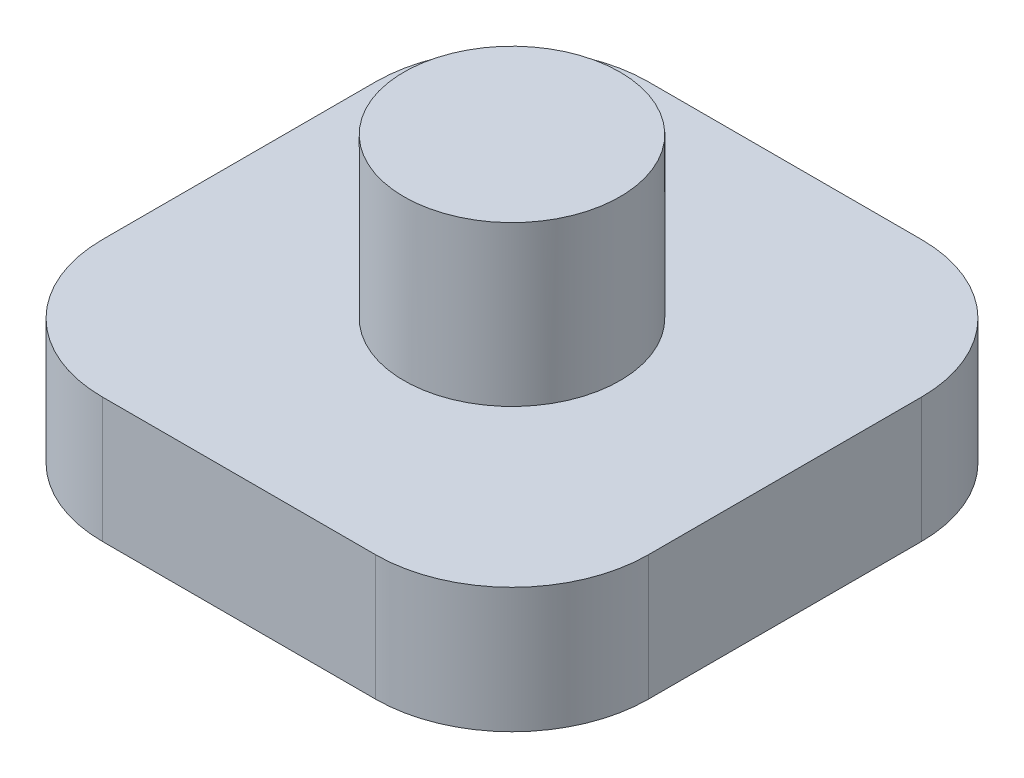
ISO-10303-21;
HEADER;
FILE_DESCRIPTION(('STEP AP214'),'2;1');
FILE_NAME('part.step','',(''),(''),'','','');
FILE_SCHEMA(('AUTOMOTIVE_DESIGN { 1 0 10303 214 1 1 1 1 }'));
ENDSEC;
DATA;
#1=APPLICATION_CONTEXT('core data for automotive mechanical design processes');
#2=APPLICATION_PROTOCOL_DEFINITION('international standard','automotive_design',2000,#1);
#3=PRODUCT_CONTEXT('',#1,'mechanical');
#4=PRODUCT('Part','Part','',(#3));
#5=PRODUCT_RELATED_PRODUCT_CATEGORY('part','',(#4));
#6=PRODUCT_DEFINITION_FORMATION('','',#4);
#7=PRODUCT_DEFINITION_CONTEXT('part definition',#1,'design');
#8=PRODUCT_DEFINITION('design','',#6,#7);
#9=PRODUCT_DEFINITION_SHAPE('','',#8);
#10=(LENGTH_UNIT() NAMED_UNIT(*) SI_UNIT(.MILLI.,.METRE.));
#11=(NAMED_UNIT(*) PLANE_ANGLE_UNIT() SI_UNIT($,.RADIAN.));
#12=(NAMED_UNIT(*) SI_UNIT($,.STERADIAN.) SOLID_ANGLE_UNIT());
#13=UNCERTAINTY_MEASURE_WITH_UNIT(LENGTH_MEASURE(1.E-05),#10,'distance_accuracy_value','');
#14=(GEOMETRIC_REPRESENTATION_CONTEXT(3) GLOBAL_UNCERTAINTY_ASSIGNED_CONTEXT((#13)) GLOBAL_UNIT_ASSIGNED_CONTEXT((#10,
#11,#12)) REPRESENTATION_CONTEXT('',''));
#15=CARTESIAN_POINT('',(0.,0.,0.));
#16=DIRECTION('',(0.,0.,1.));
#17=DIRECTION('',(1.,0.,0.));
#18=AXIS2_PLACEMENT_3D('',#15,#16,#17);
#19=CARTESIAN_POINT('',(0.,2.75,0.));
#20=DIRECTION('',(1.,0.,0.));
#21=DIRECTION('',(0.,0.,-1.));
#22=AXIS2_PLACEMENT_3D('',#19,#20,#21);
#23=PLANE('',#22);
#24=DIRECTION('',(0.,0.,1.));
#25=VECTOR('',#24,1.);
#26=CARTESIAN_POINT('',(0.,2.75,0.));
#27=LINE('',#26,#25);
#28=CARTESIAN_POINT('',(0.,2.75,-9.));
#29=VERTEX_POINT('',#28);
#30=CARTESIAN_POINT('',(0.,2.75,-3.));
#31=VERTEX_POINT('',#30);
#32=EDGE_CURVE('E127',#29,#31,#27,.T.);
#33=ORIENTED_EDGE('',*,*,#32,.F.);
#34=DIRECTION('',(0.,-1.,0.));
#35=VECTOR('',#34,1.);
#36=CARTESIAN_POINT('',(0.,2.75,-9.));
#37=LINE('',#36,#35);
#38=CARTESIAN_POINT('',(0.,0.,-9.));
#39=VERTEX_POINT('',#38);
#40=EDGE_CURVE('E11',#29,#39,#37,.T.);
#41=ORIENTED_EDGE('',*,*,#40,.T.);
#42=DIRECTION('',(0.,0.,1.));
#43=VECTOR('',#42,1.);
#44=CARTESIAN_POINT('',(0.,0.,0.));
#45=LINE('',#44,#43);
#46=CARTESIAN_POINT('',(0.,0.,-3.));
#47=VERTEX_POINT('',#46);
#48=EDGE_CURVE('E161',#39,#47,#45,.T.);
#49=ORIENTED_EDGE('',*,*,#48,.T.);
#50=DIRECTION('',(0.,-1.,0.));
#51=VECTOR('',#50,1.);
#52=CARTESIAN_POINT('',(0.,2.75,-3.));
#53=LINE('',#52,#51);
#54=EDGE_CURVE('E41',#47,#31,#53,.F.);
#55=ORIENTED_EDGE('',*,*,#54,.T.);
#56=EDGE_LOOP('',(#33,#41,#49,#55));
#57=FACE_BOUND('',#56,.T.);
#58=ADVANCED_FACE('F33',(#57),#23,.F.);
#59=CARTESIAN_POINT('',(0.,2.75,0.));
#60=DIRECTION('',(0.,0.,-1.));
#61=DIRECTION('',(-1.,0.,0.));
#62=AXIS2_PLACEMENT_3D('',#59,#60,#61);
#63=PLANE('',#62);
#64=DIRECTION('',(1.,0.,0.));
#65=VECTOR('',#64,1.);
#66=CARTESIAN_POINT('',(0.,0.,0.));
#67=LINE('',#66,#65);
#68=CARTESIAN_POINT('',(3.,0.,0.));
#69=VERTEX_POINT('',#68);
#70=CARTESIAN_POINT('',(9.,0.,0.));
#71=VERTEX_POINT('',#70);
#72=EDGE_CURVE('E132',#69,#71,#67,.T.);
#73=ORIENTED_EDGE('',*,*,#72,.T.);
#74=DIRECTION('',(0.,-1.,0.));
#75=VECTOR('',#74,1.);
#76=CARTESIAN_POINT('',(9.,2.75,0.));
#77=LINE('',#76,#75);
#78=CARTESIAN_POINT('',(9.,2.75,0.));
#79=VERTEX_POINT('',#78);
#80=EDGE_CURVE('E48',#71,#79,#77,.F.);
#81=ORIENTED_EDGE('',*,*,#80,.T.);
#82=DIRECTION('',(1.,0.,0.));
#83=VECTOR('',#82,1.);
#84=CARTESIAN_POINT('',(0.,2.75,0.));
#85=LINE('',#84,#83);
#86=CARTESIAN_POINT('',(3.,2.75,0.));
#87=VERTEX_POINT('',#86);
#88=EDGE_CURVE('E130',#87,#79,#85,.T.);
#89=ORIENTED_EDGE('',*,*,#88,.F.);
#90=DIRECTION('',(0.,-1.,0.));
#91=VECTOR('',#90,1.);
#92=CARTESIAN_POINT('',(3.,2.75,0.));
#93=LINE('',#92,#91);
#94=EDGE_CURVE('E153',#87,#69,#93,.T.);
#95=ORIENTED_EDGE('',*,*,#94,.T.);
#96=EDGE_LOOP('',(#73,#81,#89,#95));
#97=FACE_BOUND('',#96,.T.);
#98=ADVANCED_FACE('F168',(#97),#63,.F.);
#99=CARTESIAN_POINT('',(12.,2.75,0.));
#100=DIRECTION('',(-1.,0.,0.));
#101=DIRECTION('',(0.,0.,1.));
#102=AXIS2_PLACEMENT_3D('',#99,#100,#101);
#103=PLANE('',#102);
#104=DIRECTION('',(0.,0.,-1.));
#105=VECTOR('',#104,1.);
#106=CARTESIAN_POINT('',(12.,0.,0.));
#107=LINE('',#106,#105);
#108=CARTESIAN_POINT('',(12.,0.,-3.));
#109=VERTEX_POINT('',#108);
#110=CARTESIAN_POINT('',(12.,0.,-9.));
#111=VERTEX_POINT('',#110);
#112=EDGE_CURVE('E128',#109,#111,#107,.T.);
#113=ORIENTED_EDGE('',*,*,#112,.T.);
#114=DIRECTION('',(0.,-1.,0.));
#115=VECTOR('',#114,1.);
#116=CARTESIAN_POINT('',(12.,2.75,-9.));
#117=LINE('',#116,#115);
#118=CARTESIAN_POINT('',(12.,2.75,-9.));
#119=VERTEX_POINT('',#118);
#120=EDGE_CURVE('E105',#111,#119,#117,.F.);
#121=ORIENTED_EDGE('',*,*,#120,.T.);
#122=DIRECTION('',(0.,0.,-1.));
#123=VECTOR('',#122,1.);
#124=CARTESIAN_POINT('',(12.,2.75,0.));
#125=LINE('',#124,#123);
#126=CARTESIAN_POINT('',(12.,2.75,-3.));
#127=VERTEX_POINT('',#126);
#128=EDGE_CURVE('E173',#127,#119,#125,.T.);
#129=ORIENTED_EDGE('',*,*,#128,.F.);
#130=DIRECTION('',(0.,-1.,0.));
#131=VECTOR('',#130,1.);
#132=CARTESIAN_POINT('',(12.,2.75,-3.));
#133=LINE('',#132,#131);
#134=EDGE_CURVE('E110',#127,#109,#133,.T.);
#135=ORIENTED_EDGE('',*,*,#134,.T.);
#136=EDGE_LOOP('',(#113,#121,#129,#135));
#137=FACE_BOUND('',#136,.T.);
#138=ADVANCED_FACE('F194',(#137),#103,.F.);
#139=CARTESIAN_POINT('',(0.,2.75,-12.));
#140=DIRECTION('',(0.,0.,1.));
#141=DIRECTION('',(1.,0.,0.));
#142=AXIS2_PLACEMENT_3D('',#139,#140,#141);
#143=PLANE('',#142);
#144=DIRECTION('',(-1.,0.,0.));
#145=VECTOR('',#144,1.);
#146=CARTESIAN_POINT('',(0.,2.75,-12.));
#147=LINE('',#146,#145);
#148=CARTESIAN_POINT('',(9.,2.75,-12.));
#149=VERTEX_POINT('',#148);
#150=CARTESIAN_POINT('',(3.,2.75,-12.));
#151=VERTEX_POINT('',#150);
#152=EDGE_CURVE('E120',#149,#151,#147,.T.);
#153=ORIENTED_EDGE('',*,*,#152,.F.);
#154=DIRECTION('',(0.,-1.,0.));
#155=VECTOR('',#154,1.);
#156=CARTESIAN_POINT('',(9.,2.75,-12.));
#157=LINE('',#156,#155);
#158=CARTESIAN_POINT('',(9.,0.,-12.));
#159=VERTEX_POINT('',#158);
#160=EDGE_CURVE('E104',#149,#159,#157,.T.);
#161=ORIENTED_EDGE('',*,*,#160,.T.);
#162=DIRECTION('',(-1.,0.,0.));
#163=VECTOR('',#162,1.);
#164=CARTESIAN_POINT('',(0.,0.,-12.));
#165=LINE('',#164,#163);
#166=CARTESIAN_POINT('',(3.,0.,-12.));
#167=VERTEX_POINT('',#166);
#168=EDGE_CURVE('E117',#159,#167,#165,.T.);
#169=ORIENTED_EDGE('',*,*,#168,.T.);
#170=DIRECTION('',(0.,-1.,0.));
#171=VECTOR('',#170,1.);
#172=CARTESIAN_POINT('',(3.,2.75,-12.));
#173=LINE('',#172,#171);
#174=EDGE_CURVE('E122',#167,#151,#173,.F.);
#175=ORIENTED_EDGE('',*,*,#174,.T.);
#176=EDGE_LOOP('',(#153,#161,#169,#175));
#177=FACE_BOUND('',#176,.T.);
#178=ADVANCED_FACE('F116',(#177),#143,.F.);
#179=CARTESIAN_POINT('',(0.,2.75,0.));
#180=DIRECTION('',(0.,-1.,0.));
#181=DIRECTION('',(0.,0.,-1.));
#182=AXIS2_PLACEMENT_3D('',#179,#180,#181);
#183=PLANE('',#182);
#184=CARTESIAN_POINT('',(6.,2.75,-6.));
#185=DIRECTION('',(0.,-1.,0.));
#186=DIRECTION('',(0.,0.,-1.));
#187=AXIS2_PLACEMENT_3D('',#184,#185,#186);
#188=CIRCLE('',#187,2.375);
#189=CARTESIAN_POINT('',(6.,2.75,-8.375));
#190=VERTEX_POINT('',#189);
#191=EDGE_CURVE('E136',#190,#190,#188,.F.);
#192=ORIENTED_EDGE('',*,*,#191,.F.);
#193=EDGE_LOOP('',(#192));
#194=FACE_BOUND('',#193,.T.);
#195=ORIENTED_EDGE('',*,*,#128,.T.);
#196=CARTESIAN_POINT('',(9.,2.75,-9.));
#197=DIRECTION('',(0.,-1.,0.));
#198=DIRECTION('',(0.,0.,-1.));
#199=AXIS2_PLACEMENT_3D('',#196,#197,#198);
#200=CIRCLE('',#199,3.);
#201=EDGE_CURVE('E151',#119,#149,#200,.F.);
#202=ORIENTED_EDGE('',*,*,#201,.T.);
#203=ORIENTED_EDGE('',*,*,#152,.T.);
#204=CARTESIAN_POINT('',(3.,2.75,-9.));
#205=DIRECTION('',(0.,-1.,0.));
#206=DIRECTION('',(0.,0.,-1.));
#207=AXIS2_PLACEMENT_3D('',#204,#205,#206);
#208=CIRCLE('',#207,3.);
#209=EDGE_CURVE('E147',#151,#29,#208,.F.);
#210=ORIENTED_EDGE('',*,*,#209,.T.);
#211=ORIENTED_EDGE('',*,*,#32,.T.);
#212=CARTESIAN_POINT('',(3.,2.75,-3.));
#213=DIRECTION('',(0.,-1.,0.));
#214=DIRECTION('',(0.,0.,-1.));
#215=AXIS2_PLACEMENT_3D('',#212,#213,#214);
#216=CIRCLE('',#215,3.);
#217=EDGE_CURVE('E55',#31,#87,#216,.F.);
#218=ORIENTED_EDGE('',*,*,#217,.T.);
#219=ORIENTED_EDGE('',*,*,#88,.T.);
#220=CARTESIAN_POINT('',(9.,2.75,-3.));
#221=DIRECTION('',(0.,-1.,0.));
#222=DIRECTION('',(0.,0.,-1.));
#223=AXIS2_PLACEMENT_3D('',#220,#221,#222);
#224=CIRCLE('',#223,3.);
#225=EDGE_CURVE('E149',#79,#127,#224,.F.);
#226=ORIENTED_EDGE('',*,*,#225,.T.);
#227=EDGE_LOOP('',(#195,#202,#203,#210,#211,#218,#219,#226));
#228=FACE_BOUND('',#227,.T.);
#229=ADVANCED_FACE('F164',(#194,#228),#183,.F.);
#230=CARTESIAN_POINT('',(0.,0.,0.));
#231=DIRECTION('',(0.,-1.,0.));
#232=DIRECTION('',(0.,0.,-1.));
#233=AXIS2_PLACEMENT_3D('',#230,#231,#232);
#234=PLANE('',#233);
#235=ORIENTED_EDGE('',*,*,#168,.F.);
#236=CARTESIAN_POINT('',(9.,0.,-9.));
#237=DIRECTION('',(0.,-1.,0.));
#238=DIRECTION('',(0.,0.,-1.));
#239=AXIS2_PLACEMENT_3D('',#236,#237,#238);
#240=CIRCLE('',#239,3.);
#241=EDGE_CURVE('E100',#159,#111,#240,.T.);
#242=ORIENTED_EDGE('',*,*,#241,.T.);
#243=ORIENTED_EDGE('',*,*,#112,.F.);
#244=CARTESIAN_POINT('',(9.,0.,-3.));
#245=DIRECTION('',(0.,-1.,0.));
#246=DIRECTION('',(0.,0.,-1.));
#247=AXIS2_PLACEMENT_3D('',#244,#245,#246);
#248=CIRCLE('',#247,3.);
#249=EDGE_CURVE('E111',#109,#71,#248,.T.);
#250=ORIENTED_EDGE('',*,*,#249,.T.);
#251=ORIENTED_EDGE('',*,*,#72,.F.);
#252=CARTESIAN_POINT('',(3.,0.,-3.));
#253=DIRECTION('',(0.,-1.,0.));
#254=DIRECTION('',(0.,0.,-1.));
#255=AXIS2_PLACEMENT_3D('',#252,#253,#254);
#256=CIRCLE('',#255,3.);
#257=EDGE_CURVE('E121',#69,#47,#256,.T.);
#258=ORIENTED_EDGE('',*,*,#257,.T.);
#259=ORIENTED_EDGE('',*,*,#48,.F.);
#260=CARTESIAN_POINT('',(3.,0.,-9.));
#261=DIRECTION('',(0.,-1.,0.));
#262=DIRECTION('',(0.,0.,-1.));
#263=AXIS2_PLACEMENT_3D('',#260,#261,#262);
#264=CIRCLE('',#263,3.);
#265=EDGE_CURVE('E126',#39,#167,#264,.T.);
#266=ORIENTED_EDGE('',*,*,#265,.T.);
#267=EDGE_LOOP('',(#235,#242,#243,#250,#251,#258,#259,#266));
#268=FACE_BOUND('',#267,.T.);
#269=ADVANCED_FACE('F124',(#268),#234,.T.);
#270=CARTESIAN_POINT('',(6.,6.25,-6.));
#271=DIRECTION('',(0.,-1.,0.));
#272=DIRECTION('',(0.,0.,-1.));
#273=AXIS2_PLACEMENT_3D('',#270,#271,#272);
#274=CYLINDRICAL_SURFACE('',#273,2.375);
#275=CARTESIAN_POINT('',(6.,6.25,-6.));
#276=DIRECTION('',(0.,1.,0.));
#277=DIRECTION('',(0.,0.,1.));
#278=AXIS2_PLACEMENT_3D('',#275,#276,#277);
#279=CIRCLE('',#278,2.375);
#280=CARTESIAN_POINT('',(6.,6.25,-3.625));
#281=VERTEX_POINT('',#280);
#282=EDGE_CURVE('E169',#281,#281,#279,.T.);
#283=ORIENTED_EDGE('',*,*,#282,.F.);
#284=EDGE_LOOP('',(#283));
#285=FACE_BOUND('',#284,.T.);
#286=ORIENTED_EDGE('',*,*,#191,.T.);
#287=EDGE_LOOP('',(#286));
#288=FACE_BOUND('',#287,.T.);
#289=ADVANCED_FACE('F181',(#285,#288),#274,.T.);
#290=CARTESIAN_POINT('',(6.,6.25,-6.));
#291=DIRECTION('',(0.,1.,0.));
#292=DIRECTION('',(0.,0.,1.));
#293=AXIS2_PLACEMENT_3D('',#290,#291,#292);
#294=PLANE('',#293);
#295=ORIENTED_EDGE('',*,*,#282,.T.);
#296=EDGE_LOOP('',(#295));
#297=FACE_BOUND('',#296,.T.);
#298=ADVANCED_FACE('F179',(#297),#294,.T.);
#299=CARTESIAN_POINT('',(9.,2.75,-9.));
#300=DIRECTION('',(0.,-1.,0.));
#301=DIRECTION('',(0.,0.,-1.));
#302=AXIS2_PLACEMENT_3D('',#299,#300,#301);
#303=CYLINDRICAL_SURFACE('',#302,3.);
#304=ORIENTED_EDGE('',*,*,#201,.F.);
#305=ORIENTED_EDGE('',*,*,#120,.F.);
#306=ORIENTED_EDGE('',*,*,#241,.F.);
#307=ORIENTED_EDGE('',*,*,#160,.F.);
#308=EDGE_LOOP('',(#304,#305,#306,#307));
#309=FACE_BOUND('',#308,.T.);
#310=ADVANCED_FACE('F103',(#309),#303,.T.);
#311=CARTESIAN_POINT('',(9.,2.75,-3.));
#312=DIRECTION('',(0.,-1.,0.));
#313=DIRECTION('',(0.,0.,-1.));
#314=AXIS2_PLACEMENT_3D('',#311,#312,#313);
#315=CYLINDRICAL_SURFACE('',#314,3.);
#316=ORIENTED_EDGE('',*,*,#225,.F.);
#317=ORIENTED_EDGE('',*,*,#80,.F.);
#318=ORIENTED_EDGE('',*,*,#249,.F.);
#319=ORIENTED_EDGE('',*,*,#134,.F.);
#320=EDGE_LOOP('',(#316,#317,#318,#319));
#321=FACE_BOUND('',#320,.T.);
#322=ADVANCED_FACE('F206',(#321),#315,.T.);
#323=CARTESIAN_POINT('',(3.,2.75,-9.));
#324=DIRECTION('',(0.,-1.,0.));
#325=DIRECTION('',(0.,0.,-1.));
#326=AXIS2_PLACEMENT_3D('',#323,#324,#325);
#327=CYLINDRICAL_SURFACE('',#326,3.);
#328=ORIENTED_EDGE('',*,*,#209,.F.);
#329=ORIENTED_EDGE('',*,*,#174,.F.);
#330=ORIENTED_EDGE('',*,*,#265,.F.);
#331=ORIENTED_EDGE('',*,*,#40,.F.);
#332=EDGE_LOOP('',(#328,#329,#330,#331));
#333=FACE_BOUND('',#332,.T.);
#334=ADVANCED_FACE('F208',(#333),#327,.T.);
#335=CARTESIAN_POINT('',(3.,2.75,-3.));
#336=DIRECTION('',(0.,-1.,0.));
#337=DIRECTION('',(0.,0.,-1.));
#338=AXIS2_PLACEMENT_3D('',#335,#336,#337);
#339=CYLINDRICAL_SURFACE('',#338,3.);
#340=ORIENTED_EDGE('',*,*,#217,.F.);
#341=ORIENTED_EDGE('',*,*,#54,.F.);
#342=ORIENTED_EDGE('',*,*,#257,.F.);
#343=ORIENTED_EDGE('',*,*,#94,.F.);
#344=EDGE_LOOP('',(#340,#341,#342,#343));
#345=FACE_BOUND('',#344,.T.);
#346=ADVANCED_FACE('F35',(#345),#339,.T.);
#347=CLOSED_SHELL('',(#58,#98,#138,#178,#229,#269,#289,#298,#310,#322,#334,#346));
#348=MANIFOLD_SOLID_BREP('B2',#347);
#349=ADVANCED_BREP_SHAPE_REPRESENTATION('',(#18,#348),#14);
#350=SHAPE_DEFINITION_REPRESENTATION(#9,#349);
ENDSEC;
END-ISO-10303-21;
